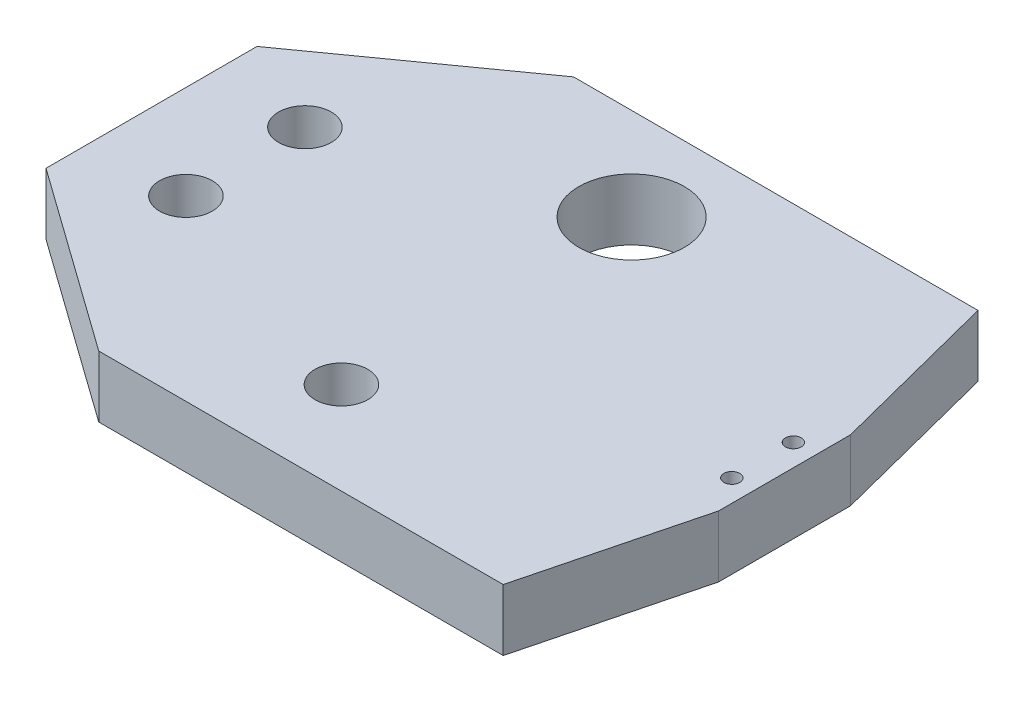
ISO-10303-21;
HEADER;
FILE_DESCRIPTION(('STEP AP214'),'2;1');
FILE_NAME('part.step','',(''),(''),'','','');
FILE_SCHEMA(('AUTOMOTIVE_DESIGN { 1 0 10303 214 1 1 1 1 }'));
ENDSEC;
DATA;
#1=APPLICATION_CONTEXT('core data for automotive mechanical design processes');
#2=APPLICATION_PROTOCOL_DEFINITION('international standard','automotive_design',2000,#1);
#3=PRODUCT_CONTEXT('',#1,'mechanical');
#4=PRODUCT('Part','Part','',(#3));
#5=PRODUCT_RELATED_PRODUCT_CATEGORY('part','',(#4));
#6=PRODUCT_DEFINITION_FORMATION('','',#4);
#7=PRODUCT_DEFINITION_CONTEXT('part definition',#1,'design');
#8=PRODUCT_DEFINITION('design','',#6,#7);
#9=PRODUCT_DEFINITION_SHAPE('','',#8);
#10=(LENGTH_UNIT() NAMED_UNIT(*) SI_UNIT(.MILLI.,.METRE.));
#11=(NAMED_UNIT(*) PLANE_ANGLE_UNIT() SI_UNIT($,.RADIAN.));
#12=(NAMED_UNIT(*) SI_UNIT($,.STERADIAN.) SOLID_ANGLE_UNIT());
#13=UNCERTAINTY_MEASURE_WITH_UNIT(LENGTH_MEASURE(1.E-05),#10,'distance_accuracy_value','');
#14=(GEOMETRIC_REPRESENTATION_CONTEXT(3) GLOBAL_UNCERTAINTY_ASSIGNED_CONTEXT((#13)) GLOBAL_UNIT_ASSIGNED_CONTEXT((#10,
#11,#12)) REPRESENTATION_CONTEXT('',''));
#15=CARTESIAN_POINT('',(0.,0.,0.));
#16=DIRECTION('',(0.,0.,1.));
#17=DIRECTION('',(1.,0.,0.));
#18=AXIS2_PLACEMENT_3D('',#15,#16,#17);
#19=CARTESIAN_POINT('',(-146.127490257363,15.1666666666667,-27.0000000000001));
#20=DIRECTION('',(0.,0.,1.));
#21=DIRECTION('',(1.,0.,0.));
#22=AXIS2_PLACEMENT_3D('',#19,#20,#21);
#23=PLANE('',#22);
#24=DIRECTION('',(-1.,0.,0.));
#25=VECTOR('',#24,1.);
#26=CARTESIAN_POINT('',(-146.127490257363,8.16666666666666,-27.0000000000001));
#27=LINE('',#26,#25);
#28=CARTESIAN_POINT('',(-100.127490257363,8.16666666666666,-27.0000000000001));
#29=VERTEX_POINT('',#28);
#30=CARTESIAN_POINT('',(-146.127490257363,8.16666666666666,-27.0000000000001));
#31=VERTEX_POINT('',#30);
#32=EDGE_CURVE('E158',#29,#31,#27,.T.);
#33=ORIENTED_EDGE('',*,*,#32,.T.);
#34=DIRECTION('',(0.,-1.,0.));
#35=VECTOR('',#34,1.);
#36=CARTESIAN_POINT('',(-146.127490257363,15.1666666666667,-27.0000000000001));
#37=LINE('',#36,#35);
#38=CARTESIAN_POINT('',(-146.127490257363,15.1666666666667,-27.0000000000001));
#39=VERTEX_POINT('',#38);
#40=EDGE_CURVE('E11',#39,#31,#37,.T.);
#41=ORIENTED_EDGE('',*,*,#40,.F.);
#42=DIRECTION('',(-1.,0.,0.));
#43=VECTOR('',#42,1.);
#44=CARTESIAN_POINT('',(-146.127490257363,15.1666666666667,-27.0000000000001));
#45=LINE('',#44,#43);
#46=CARTESIAN_POINT('',(-100.127490257363,15.1666666666667,-27.0000000000001));
#47=VERTEX_POINT('',#46);
#48=EDGE_CURVE('E117',#47,#39,#45,.T.);
#49=ORIENTED_EDGE('',*,*,#48,.F.);
#50=DIRECTION('',(0.,1.,0.));
#51=VECTOR('',#50,1.);
#52=CARTESIAN_POINT('',(-100.127490257363,-47.8779584101415,-27.0000000000001));
#53=LINE('',#52,#51);
#54=EDGE_CURVE('E143',#29,#47,#53,.T.);
#55=ORIENTED_EDGE('',*,*,#54,.F.);
#56=EDGE_LOOP('',(#33,#41,#49,#55));
#57=FACE_BOUND('',#56,.T.);
#58=ADVANCED_FACE('F34',(#57),#23,.F.);
#59=CARTESIAN_POINT('',(-167.127490257363,15.1666666666667,-12.0000000000003));
#60=DIRECTION('',(0.581238193719092,0.,0.813733471206739));
#61=DIRECTION('',(0.813733471206739,0.,-0.581238193719092));
#62=AXIS2_PLACEMENT_3D('',#59,#60,#61);
#63=PLANE('',#62);
#64=DIRECTION('',(-0.813733471206738,0.,0.581238193719092));
#65=VECTOR('',#64,1.);
#66=CARTESIAN_POINT('',(-167.127490257363,8.16666666666666,-12.0000000000003));
#67=LINE('',#66,#65);
#68=CARTESIAN_POINT('',(-167.127490257363,8.16666666666666,-12.0000000000003));
#69=VERTEX_POINT('',#68);
#70=EDGE_CURVE('E168',#31,#69,#67,.T.);
#71=ORIENTED_EDGE('',*,*,#70,.T.);
#72=DIRECTION('',(0.,-1.,0.));
#73=VECTOR('',#72,1.);
#74=CARTESIAN_POINT('',(-167.127490257363,15.1666666666667,-12.0000000000003));
#75=LINE('',#74,#73);
#76=CARTESIAN_POINT('',(-167.127490257363,15.1666666666667,-12.0000000000003));
#77=VERTEX_POINT('',#76);
#78=EDGE_CURVE('E42',#77,#69,#75,.T.);
#79=ORIENTED_EDGE('',*,*,#78,.F.);
#80=DIRECTION('',(-0.813733471206738,0.,0.581238193719092));
#81=VECTOR('',#80,1.);
#82=CARTESIAN_POINT('',(-167.127490257363,15.1666666666667,-12.0000000000003));
#83=LINE('',#82,#81);
#84=EDGE_CURVE('E81',#39,#77,#83,.T.);
#85=ORIENTED_EDGE('',*,*,#84,.F.);
#86=ORIENTED_EDGE('',*,*,#40,.T.);
#87=EDGE_LOOP('',(#71,#79,#85,#86));
#88=FACE_BOUND('',#87,.T.);
#89=ADVANCED_FACE('F178',(#88),#63,.F.);
#90=CARTESIAN_POINT('',(-167.127490257363,15.1666666666667,-12.0000000000003));
#91=DIRECTION('',(1.,0.,0.));
#92=DIRECTION('',(0.,0.,-1.));
#93=AXIS2_PLACEMENT_3D('',#90,#91,#92);
#94=PLANE('',#93);
#95=DIRECTION('',(0.,0.,1.));
#96=VECTOR('',#95,1.);
#97=CARTESIAN_POINT('',(-167.127490257363,8.16666666666666,-12.0000000000003));
#98=LINE('',#97,#96);
#99=CARTESIAN_POINT('',(-167.127490257363,8.16666666666666,11.9999999999997));
#100=VERTEX_POINT('',#99);
#101=EDGE_CURVE('E68',#69,#100,#98,.T.);
#102=ORIENTED_EDGE('',*,*,#101,.T.);
#103=DIRECTION('',(0.,-1.,0.));
#104=VECTOR('',#103,1.);
#105=CARTESIAN_POINT('',(-167.127490257363,15.1666666666667,11.9999999999997));
#106=LINE('',#105,#104);
#107=CARTESIAN_POINT('',(-167.127490257363,15.1666666666667,11.9999999999997));
#108=VERTEX_POINT('',#107);
#109=EDGE_CURVE('E173',#108,#100,#106,.T.);
#110=ORIENTED_EDGE('',*,*,#109,.F.);
#111=DIRECTION('',(0.,0.,1.));
#112=VECTOR('',#111,1.);
#113=CARTESIAN_POINT('',(-167.127490257363,15.1666666666667,-12.0000000000003));
#114=LINE('',#113,#112);
#115=EDGE_CURVE('E161',#77,#108,#114,.T.);
#116=ORIENTED_EDGE('',*,*,#115,.F.);
#117=ORIENTED_EDGE('',*,*,#78,.T.);
#118=EDGE_LOOP('',(#102,#110,#116,#117));
#119=FACE_BOUND('',#118,.T.);
#120=ADVANCED_FACE('F175',(#119),#94,.F.);
#121=CARTESIAN_POINT('',(-167.127490257363,15.1666666666667,11.9999999999997));
#122=DIRECTION('',(0.581238193719101,0.,-0.813733471206731));
#123=DIRECTION('',(-0.813733471206731,0.,-0.581238193719101));
#124=AXIS2_PLACEMENT_3D('',#121,#122,#123);
#125=PLANE('',#124);
#126=DIRECTION('',(0.813733471206731,0.,0.581238193719101));
#127=VECTOR('',#126,1.);
#128=CARTESIAN_POINT('',(-167.127490257363,8.16666666666666,11.9999999999997));
#129=LINE('',#128,#127);
#130=CARTESIAN_POINT('',(-146.127490257363,8.16666666666666,26.9999999999999));
#131=VERTEX_POINT('',#130);
#132=EDGE_CURVE('E74',#100,#131,#129,.T.);
#133=ORIENTED_EDGE('',*,*,#132,.T.);
#134=DIRECTION('',(0.,-1.,0.));
#135=VECTOR('',#134,1.);
#136=CARTESIAN_POINT('',(-146.127490257363,15.1666666666667,26.9999999999999));
#137=LINE('',#136,#135);
#138=CARTESIAN_POINT('',(-146.127490257363,15.1666666666667,26.9999999999999));
#139=VERTEX_POINT('',#138);
#140=EDGE_CURVE('E115',#139,#131,#137,.T.);
#141=ORIENTED_EDGE('',*,*,#140,.F.);
#142=DIRECTION('',(0.813733471206731,0.,0.581238193719101));
#143=VECTOR('',#142,1.);
#144=CARTESIAN_POINT('',(-167.127490257363,15.1666666666667,11.9999999999997));
#145=LINE('',#144,#143);
#146=EDGE_CURVE('E50',#108,#139,#145,.T.);
#147=ORIENTED_EDGE('',*,*,#146,.F.);
#148=ORIENTED_EDGE('',*,*,#109,.T.);
#149=EDGE_LOOP('',(#133,#141,#147,#148));
#150=FACE_BOUND('',#149,.T.);
#151=ADVANCED_FACE('F254',(#150),#125,.F.);
#152=CARTESIAN_POINT('',(-146.127490257363,15.1666666666667,26.9999999999999));
#153=DIRECTION('',(0.,0.,-1.));
#154=DIRECTION('',(-1.,0.,0.));
#155=AXIS2_PLACEMENT_3D('',#152,#153,#154);
#156=PLANE('',#155);
#157=DIRECTION('',(1.,0.,0.));
#158=VECTOR('',#157,1.);
#159=CARTESIAN_POINT('',(-146.127490257363,8.16666666666666,26.9999999999999));
#160=LINE('',#159,#158);
#161=CARTESIAN_POINT('',(-100.127490257363,8.16666666666666,26.9999999999999));
#162=VERTEX_POINT('',#161);
#163=EDGE_CURVE('E108',#131,#162,#160,.T.);
#164=ORIENTED_EDGE('',*,*,#163,.T.);
#165=DIRECTION('',(0.,1.,0.));
#166=VECTOR('',#165,1.);
#167=CARTESIAN_POINT('',(-100.127490257363,-47.8779584101415,26.9999999999999));
#168=LINE('',#167,#166);
#169=CARTESIAN_POINT('',(-100.127490257363,15.1666666666667,26.9999999999999));
#170=VERTEX_POINT('',#169);
#171=EDGE_CURVE('E113',#162,#170,#168,.T.);
#172=ORIENTED_EDGE('',*,*,#171,.T.);
#173=DIRECTION('',(1.,0.,0.));
#174=VECTOR('',#173,1.);
#175=CARTESIAN_POINT('',(-146.127490257363,15.1666666666667,26.9999999999999));
#176=LINE('',#175,#174);
#177=EDGE_CURVE('E164',#139,#170,#176,.T.);
#178=ORIENTED_EDGE('',*,*,#177,.F.);
#179=ORIENTED_EDGE('',*,*,#140,.T.);
#180=EDGE_LOOP('',(#164,#172,#178,#179));
#181=FACE_BOUND('',#180,.T.);
#182=ADVANCED_FACE('F110',(#181),#156,.F.);
#183=CARTESIAN_POINT('',(-95.1274902573635,15.1666666666667,0.));
#184=DIRECTION('',(0.,-1.,0.));
#185=DIRECTION('',(0.,0.,-1.));
#186=AXIS2_PLACEMENT_3D('',#183,#184,#185);
#187=PLANE('',#186);
#188=CARTESIAN_POINT('',(-129.026378717213,15.1666666666667,-16.5000000000001));
#189=DIRECTION('',(0.,-1.,0.));
#190=DIRECTION('',(0.,0.,-1.));
#191=AXIS2_PLACEMENT_3D('',#188,#189,#190);
#192=CIRCLE('',#191,6.);
#193=CARTESIAN_POINT('',(-129.026378717213,15.1666666666667,-22.5000000000001));
#194=VERTEX_POINT('',#193);
#195=EDGE_CURVE('E211',#194,#194,#192,.T.);
#196=ORIENTED_EDGE('',*,*,#195,.T.);
#197=EDGE_LOOP('',(#196));
#198=FACE_BOUND('',#197,.T.);
#199=CARTESIAN_POINT('',(-97.6274902573635,15.1666666666667,-3.50000000000007));
#200=DIRECTION('',(0.,-1.,0.));
#201=DIRECTION('',(0.,0.,-1.));
#202=AXIS2_PLACEMENT_3D('',#199,#200,#201);
#203=CIRCLE('',#202,0.900000000000004);
#204=CARTESIAN_POINT('',(-97.6274902573635,15.1666666666667,-4.40000000000007));
#205=VERTEX_POINT('',#204);
#206=EDGE_CURVE('E205',#205,#205,#203,.T.);
#207=ORIENTED_EDGE('',*,*,#206,.T.);
#208=EDGE_LOOP('',(#207));
#209=FACE_BOUND('',#208,.T.);
#210=CARTESIAN_POINT('',(-97.6274902573635,15.1666666666667,3.49999999999993));
#211=DIRECTION('',(0.,-1.,0.));
#212=DIRECTION('',(0.,0.,-1.));
#213=AXIS2_PLACEMENT_3D('',#210,#211,#212);
#214=CIRCLE('',#213,0.900000000000003);
#215=CARTESIAN_POINT('',(-97.6274902573635,15.1666666666667,2.59999999999993));
#216=VERTEX_POINT('',#215);
#217=EDGE_CURVE('E198',#216,#216,#214,.T.);
#218=ORIENTED_EDGE('',*,*,#217,.T.);
#219=EDGE_LOOP('',(#218));
#220=FACE_BOUND('',#219,.T.);
#221=CARTESIAN_POINT('',(-156.444259888883,15.1666666666667,6.76721851467612));
#222=DIRECTION('',(0.,1.,0.));
#223=DIRECTION('',(0.,0.,1.));
#224=AXIS2_PLACEMENT_3D('',#221,#222,#223);
#225=CIRCLE('',#224,3.);
#226=CARTESIAN_POINT('',(-156.444259888883,15.1666666666667,9.76721851467613));
#227=VERTEX_POINT('',#226);
#228=EDGE_CURVE('E139',#227,#227,#225,.T.);
#229=ORIENTED_EDGE('',*,*,#228,.F.);
#230=EDGE_LOOP('',(#229));
#231=FACE_BOUND('',#230,.T.);
#232=CARTESIAN_POINT('',(-129.026378717213,15.1666666666667,16.4999999999999));
#233=DIRECTION('',(0.,1.,0.));
#234=DIRECTION('',(0.,0.,1.));
#235=AXIS2_PLACEMENT_3D('',#232,#233,#234);
#236=CIRCLE('',#235,3.);
#237=CARTESIAN_POINT('',(-129.026378717213,15.1666666666667,19.4999999999999));
#238=VERTEX_POINT('',#237);
#239=EDGE_CURVE('E146',#238,#238,#236,.T.);
#240=ORIENTED_EDGE('',*,*,#239,.F.);
#241=EDGE_LOOP('',(#240));
#242=FACE_BOUND('',#241,.T.);
#243=CARTESIAN_POINT('',(-156.444259888883,15.1666666666667,-6.76721851467625));
#244=DIRECTION('',(0.,1.,0.));
#245=DIRECTION('',(0.,0.,1.));
#246=AXIS2_PLACEMENT_3D('',#243,#244,#245);
#247=CIRCLE('',#246,3.);
#248=CARTESIAN_POINT('',(-156.444259888883,15.1666666666667,-3.76721851467625));
#249=VERTEX_POINT('',#248);
#250=EDGE_CURVE('E152',#249,#249,#247,.T.);
#251=ORIENTED_EDGE('',*,*,#250,.F.);
#252=EDGE_LOOP('',(#251));
#253=FACE_BOUND('',#252,.T.);
#254=ORIENTED_EDGE('',*,*,#48,.T.);
#255=ORIENTED_EDGE('',*,*,#84,.T.);
#256=ORIENTED_EDGE('',*,*,#115,.T.);
#257=ORIENTED_EDGE('',*,*,#146,.T.);
#258=ORIENTED_EDGE('',*,*,#177,.T.);
#259=DIRECTION('',(0.248375350267704,0.,-0.968663866044045));
#260=VECTOR('',#259,1.);
#261=CARTESIAN_POINT('',(-95.1274902573635,15.1666666666667,7.49999999999993));
#262=LINE('',#261,#260);
#263=CARTESIAN_POINT('',(-95.1274902573635,15.1666666666667,7.49999999999993));
#264=VERTEX_POINT('',#263);
#265=EDGE_CURVE('E130',#170,#264,#262,.T.);
#266=ORIENTED_EDGE('',*,*,#265,.T.);
#267=DIRECTION('',(0.,0.,-1.));
#268=VECTOR('',#267,1.);
#269=CARTESIAN_POINT('',(-95.1274902573635,15.1666666666667,7.49999999999993));
#270=LINE('',#269,#268);
#271=CARTESIAN_POINT('',(-95.1274902573635,15.1666666666667,-7.50000000000007));
#272=VERTEX_POINT('',#271);
#273=EDGE_CURVE('E134',#264,#272,#270,.T.);
#274=ORIENTED_EDGE('',*,*,#273,.T.);
#275=DIRECTION('',(-0.248375350267704,0.,-0.968663866044045));
#276=VECTOR('',#275,1.);
#277=CARTESIAN_POINT('',(-95.1274902573635,15.1666666666667,-7.50000000000007));
#278=LINE('',#277,#276);
#279=EDGE_CURVE('E131',#272,#47,#278,.T.);
#280=ORIENTED_EDGE('',*,*,#279,.T.);
#281=EDGE_LOOP('',(#254,#255,#256,#257,#258,#266,#274,#280));
#282=FACE_BOUND('',#281,.T.);
#283=ADVANCED_FACE('F197',(#198,#209,#220,#231,#242,#253,#282),#187,.F.);
#284=CARTESIAN_POINT('',(-95.1274902573635,8.16666666666666,0.));
#285=DIRECTION('',(0.,-1.,0.));
#286=DIRECTION('',(0.,0.,-1.));
#287=AXIS2_PLACEMENT_3D('',#284,#285,#286);
#288=PLANE('',#287);
#289=CARTESIAN_POINT('',(-129.026378717213,8.16666666666666,-16.5000000000001));
#290=DIRECTION('',(0.,-1.,0.));
#291=DIRECTION('',(0.,0.,-1.));
#292=AXIS2_PLACEMENT_3D('',#289,#290,#291);
#293=CIRCLE('',#292,6.);
#294=CARTESIAN_POINT('',(-129.026378717213,8.16666666666666,-22.5000000000001));
#295=VERTEX_POINT('',#294);
#296=EDGE_CURVE('E214',#295,#295,#293,.T.);
#297=ORIENTED_EDGE('',*,*,#296,.F.);
#298=EDGE_LOOP('',(#297));
#299=FACE_BOUND('',#298,.T.);
#300=CARTESIAN_POINT('',(-97.6274902573635,8.16666666666666,-3.50000000000007));
#301=DIRECTION('',(0.,-1.,0.));
#302=DIRECTION('',(0.,0.,-1.));
#303=AXIS2_PLACEMENT_3D('',#300,#301,#302);
#304=CIRCLE('',#303,0.900000000000004);
#305=CARTESIAN_POINT('',(-97.6274902573635,8.16666666666666,-4.40000000000007));
#306=VERTEX_POINT('',#305);
#307=EDGE_CURVE('E208',#306,#306,#304,.T.);
#308=ORIENTED_EDGE('',*,*,#307,.F.);
#309=EDGE_LOOP('',(#308));
#310=FACE_BOUND('',#309,.T.);
#311=CARTESIAN_POINT('',(-97.6274902573635,8.16666666666666,3.49999999999993));
#312=DIRECTION('',(0.,-1.,0.));
#313=DIRECTION('',(0.,0.,-1.));
#314=AXIS2_PLACEMENT_3D('',#311,#312,#313);
#315=CIRCLE('',#314,0.900000000000003);
#316=CARTESIAN_POINT('',(-97.6274902573635,8.16666666666666,2.59999999999993));
#317=VERTEX_POINT('',#316);
#318=EDGE_CURVE('E200',#317,#317,#315,.T.);
#319=ORIENTED_EDGE('',*,*,#318,.F.);
#320=EDGE_LOOP('',(#319));
#321=FACE_BOUND('',#320,.T.);
#322=CARTESIAN_POINT('',(-156.444259888883,8.16666666666667,6.76721851467612));
#323=DIRECTION('',(0.,1.,0.));
#324=DIRECTION('',(0.,0.,1.));
#325=AXIS2_PLACEMENT_3D('',#322,#323,#324);
#326=CIRCLE('',#325,2.99999999999999);
#327=CARTESIAN_POINT('',(-156.444259888883,8.16666666666667,9.76721851467612));
#328=VERTEX_POINT('',#327);
#329=EDGE_CURVE('E142',#328,#328,#326,.T.);
#330=ORIENTED_EDGE('',*,*,#329,.T.);
#331=EDGE_LOOP('',(#330));
#332=FACE_BOUND('',#331,.T.);
#333=CARTESIAN_POINT('',(-129.026378717213,8.16666666666667,16.4999999999999));
#334=DIRECTION('',(0.,1.,0.));
#335=DIRECTION('',(0.,0.,1.));
#336=AXIS2_PLACEMENT_3D('',#333,#334,#335);
#337=CIRCLE('',#336,2.99999999999999);
#338=CARTESIAN_POINT('',(-129.026378717213,8.16666666666667,19.4999999999999));
#339=VERTEX_POINT('',#338);
#340=EDGE_CURVE('E149',#339,#339,#337,.T.);
#341=ORIENTED_EDGE('',*,*,#340,.T.);
#342=EDGE_LOOP('',(#341));
#343=FACE_BOUND('',#342,.T.);
#344=CARTESIAN_POINT('',(-156.444259888883,8.16666666666667,-6.76721851467625));
#345=DIRECTION('',(0.,1.,0.));
#346=DIRECTION('',(0.,0.,1.));
#347=AXIS2_PLACEMENT_3D('',#344,#345,#346);
#348=CIRCLE('',#347,2.99999999999999);
#349=CARTESIAN_POINT('',(-156.444259888883,8.16666666666667,-3.76721851467626));
#350=VERTEX_POINT('',#349);
#351=EDGE_CURVE('E155',#350,#350,#348,.T.);
#352=ORIENTED_EDGE('',*,*,#351,.T.);
#353=EDGE_LOOP('',(#352));
#354=FACE_BOUND('',#353,.T.);
#355=ORIENTED_EDGE('',*,*,#32,.F.);
#356=DIRECTION('',(-0.248375350267704,0.,-0.968663866044045));
#357=VECTOR('',#356,1.);
#358=CARTESIAN_POINT('',(-95.1274902573635,8.16666666666666,-7.50000000000007));
#359=LINE('',#358,#357);
#360=CARTESIAN_POINT('',(-95.1274902573635,8.16666666666666,-7.50000000000007));
#361=VERTEX_POINT('',#360);
#362=EDGE_CURVE('E184',#361,#29,#359,.T.);
#363=ORIENTED_EDGE('',*,*,#362,.F.);
#364=DIRECTION('',(0.,0.,-1.));
#365=VECTOR('',#364,1.);
#366=CARTESIAN_POINT('',(-95.1274902573635,8.16666666666666,7.49999999999993));
#367=LINE('',#366,#365);
#368=CARTESIAN_POINT('',(-95.1274902573635,8.16666666666666,7.49999999999993));
#369=VERTEX_POINT('',#368);
#370=EDGE_CURVE('E123',#369,#361,#367,.T.);
#371=ORIENTED_EDGE('',*,*,#370,.F.);
#372=DIRECTION('',(0.248375350267704,0.,-0.968663866044045));
#373=VECTOR('',#372,1.);
#374=CARTESIAN_POINT('',(-95.1274902573635,8.16666666666666,7.49999999999993));
#375=LINE('',#374,#373);
#376=EDGE_CURVE('E120',#162,#369,#375,.T.);
#377=ORIENTED_EDGE('',*,*,#376,.F.);
#378=ORIENTED_EDGE('',*,*,#163,.F.);
#379=ORIENTED_EDGE('',*,*,#132,.F.);
#380=ORIENTED_EDGE('',*,*,#101,.F.);
#381=ORIENTED_EDGE('',*,*,#70,.F.);
#382=EDGE_LOOP('',(#355,#363,#371,#377,#378,#379,#380,#381));
#383=FACE_BOUND('',#382,.T.);
#384=ADVANCED_FACE('F121',(#299,#310,#321,#332,#343,#354,#383),#288,.T.);
#385=CARTESIAN_POINT('',(-156.444259888883,15.1666666666667,-6.76721851467625));
#386=DIRECTION('',(0.,1.,0.));
#387=DIRECTION('',(0.,0.,1.));
#388=AXIS2_PLACEMENT_3D('',#385,#386,#387);
#389=CYLINDRICAL_SURFACE('',#388,3.);
#390=ORIENTED_EDGE('',*,*,#351,.F.);
#391=EDGE_LOOP('',(#390));
#392=FACE_BOUND('',#391,.T.);
#393=ORIENTED_EDGE('',*,*,#250,.T.);
#394=EDGE_LOOP('',(#393));
#395=FACE_BOUND('',#394,.T.);
#396=ADVANCED_FACE('F231',(#392,#395),#389,.F.);
#397=CARTESIAN_POINT('',(-129.026378717213,15.1666666666667,16.4999999999999));
#398=DIRECTION('',(0.,1.,0.));
#399=DIRECTION('',(0.,0.,1.));
#400=AXIS2_PLACEMENT_3D('',#397,#398,#399);
#401=CYLINDRICAL_SURFACE('',#400,2.99999999999999);
#402=ORIENTED_EDGE('',*,*,#340,.F.);
#403=EDGE_LOOP('',(#402));
#404=FACE_BOUND('',#403,.T.);
#405=ORIENTED_EDGE('',*,*,#239,.T.);
#406=EDGE_LOOP('',(#405));
#407=FACE_BOUND('',#406,.T.);
#408=ADVANCED_FACE('F245',(#404,#407),#401,.F.);
#409=CARTESIAN_POINT('',(-156.444259888883,15.1666666666667,6.76721851467612));
#410=DIRECTION('',(0.,1.,0.));
#411=DIRECTION('',(0.,0.,1.));
#412=AXIS2_PLACEMENT_3D('',#409,#410,#411);
#413=CYLINDRICAL_SURFACE('',#412,3.);
#414=ORIENTED_EDGE('',*,*,#329,.F.);
#415=EDGE_LOOP('',(#414));
#416=FACE_BOUND('',#415,.T.);
#417=ORIENTED_EDGE('',*,*,#228,.T.);
#418=EDGE_LOOP('',(#417));
#419=FACE_BOUND('',#418,.T.);
#420=ADVANCED_FACE('F289',(#416,#419),#413,.F.);
#421=CARTESIAN_POINT('',(-95.1274902573635,-47.8779584101415,7.49999999999993));
#422=DIRECTION('',(0.968663866044045,0.,0.248375350267704));
#423=DIRECTION('',(0.248375350267704,0.,-0.968663866044045));
#424=AXIS2_PLACEMENT_3D('',#421,#422,#423);
#425=PLANE('',#424);
#426=ORIENTED_EDGE('',*,*,#171,.F.);
#427=ORIENTED_EDGE('',*,*,#376,.T.);
#428=DIRECTION('',(0.,1.,0.));
#429=VECTOR('',#428,1.);
#430=CARTESIAN_POINT('',(-95.1274902573635,-47.8779584101415,7.49999999999993));
#431=LINE('',#430,#429);
#432=EDGE_CURVE('E126',#369,#264,#431,.T.);
#433=ORIENTED_EDGE('',*,*,#432,.T.);
#434=ORIENTED_EDGE('',*,*,#265,.F.);
#435=EDGE_LOOP('',(#426,#427,#433,#434));
#436=FACE_BOUND('',#435,.T.);
#437=ADVANCED_FACE('F128',(#436),#425,.T.);
#438=CARTESIAN_POINT('',(-95.1274902573635,-47.8779584101415,7.49999999999993));
#439=DIRECTION('',(1.,0.,0.));
#440=DIRECTION('',(0.,0.,-1.));
#441=AXIS2_PLACEMENT_3D('',#438,#439,#440);
#442=PLANE('',#441);
#443=ORIENTED_EDGE('',*,*,#432,.F.);
#444=ORIENTED_EDGE('',*,*,#370,.T.);
#445=DIRECTION('',(0.,1.,0.));
#446=VECTOR('',#445,1.);
#447=CARTESIAN_POINT('',(-95.1274902573635,-47.8779584101415,-7.50000000000007));
#448=LINE('',#447,#446);
#449=EDGE_CURVE('E188',#361,#272,#448,.T.);
#450=ORIENTED_EDGE('',*,*,#449,.T.);
#451=ORIENTED_EDGE('',*,*,#273,.F.);
#452=EDGE_LOOP('',(#443,#444,#450,#451));
#453=FACE_BOUND('',#452,.T.);
#454=ADVANCED_FACE('F196',(#453),#442,.T.);
#455=CARTESIAN_POINT('',(-95.1274902573635,-47.8779584101415,-7.50000000000007));
#456=DIRECTION('',(0.968663866044045,0.,-0.248375350267704));
#457=DIRECTION('',(-0.248375350267704,0.,-0.968663866044045));
#458=AXIS2_PLACEMENT_3D('',#455,#456,#457);
#459=PLANE('',#458);
#460=ORIENTED_EDGE('',*,*,#449,.F.);
#461=ORIENTED_EDGE('',*,*,#362,.T.);
#462=ORIENTED_EDGE('',*,*,#54,.T.);
#463=ORIENTED_EDGE('',*,*,#279,.F.);
#464=EDGE_LOOP('',(#460,#461,#462,#463));
#465=FACE_BOUND('',#464,.T.);
#466=ADVANCED_FACE('F187',(#465),#459,.T.);
#467=CARTESIAN_POINT('',(-97.6274902573635,15.1666666666667,3.49999999999993));
#468=DIRECTION('',(0.,-1.,0.));
#469=DIRECTION('',(0.,0.,-1.));
#470=AXIS2_PLACEMENT_3D('',#467,#468,#469);
#471=CYLINDRICAL_SURFACE('',#470,0.900000000000003);
#472=ORIENTED_EDGE('',*,*,#217,.F.);
#473=EDGE_LOOP('',(#472));
#474=FACE_BOUND('',#473,.T.);
#475=ORIENTED_EDGE('',*,*,#318,.T.);
#476=EDGE_LOOP('',(#475));
#477=FACE_BOUND('',#476,.T.);
#478=ADVANCED_FACE('F308',(#474,#477),#471,.F.);
#479=CARTESIAN_POINT('',(-97.6274902573635,15.1666666666667,-3.50000000000007));
#480=DIRECTION('',(0.,-1.,0.));
#481=DIRECTION('',(0.,0.,-1.));
#482=AXIS2_PLACEMENT_3D('',#479,#480,#481);
#483=CYLINDRICAL_SURFACE('',#482,0.900000000000004);
#484=ORIENTED_EDGE('',*,*,#206,.F.);
#485=EDGE_LOOP('',(#484));
#486=FACE_BOUND('',#485,.T.);
#487=ORIENTED_EDGE('',*,*,#307,.T.);
#488=EDGE_LOOP('',(#487));
#489=FACE_BOUND('',#488,.T.);
#490=ADVANCED_FACE('F225',(#486,#489),#483,.F.);
#491=CARTESIAN_POINT('',(-129.026378717213,15.1666666666667,-16.5000000000001));
#492=DIRECTION('',(0.,-1.,0.));
#493=DIRECTION('',(0.,0.,-1.));
#494=AXIS2_PLACEMENT_3D('',#491,#492,#493);
#495=CYLINDRICAL_SURFACE('',#494,6.);
#496=ORIENTED_EDGE('',*,*,#195,.F.);
#497=EDGE_LOOP('',(#496));
#498=FACE_BOUND('',#497,.T.);
#499=ORIENTED_EDGE('',*,*,#296,.T.);
#500=EDGE_LOOP('',(#499));
#501=FACE_BOUND('',#500,.T.);
#502=ADVANCED_FACE('F222',(#498,#501),#495,.F.);
#503=CLOSED_SHELL('',(#58,#89,#120,#151,#182,#283,#384,#396,#408,#420,#437,#454,#466,#478,#490,#502));
#504=MANIFOLD_SOLID_BREP('B2',#503);
#505=ADVANCED_BREP_SHAPE_REPRESENTATION('',(#18,#504),#14);
#506=SHAPE_DEFINITION_REPRESENTATION(#9,#505);
ENDSEC;
END-ISO-10303-21;
